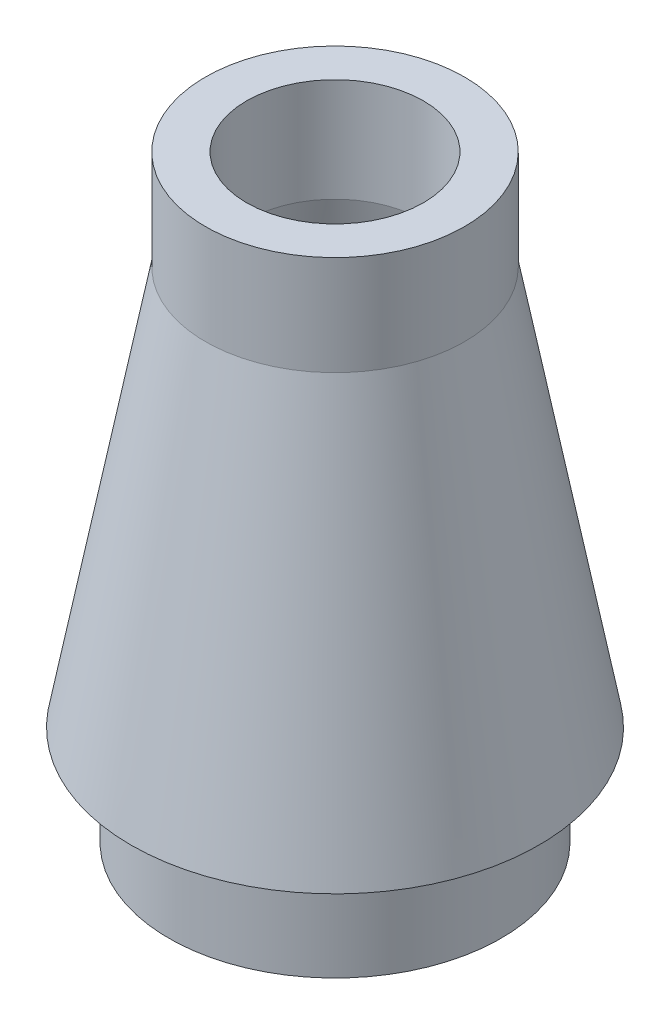
ISO-10303-21;
HEADER;
FILE_DESCRIPTION(('STEP AP214'),'2;1');
FILE_NAME('part.step','',(''),(''),'','','');
FILE_SCHEMA(('AUTOMOTIVE_DESIGN { 1 0 10303 214 1 1 1 1 }'));
ENDSEC;
DATA;
#1=APPLICATION_CONTEXT('core data for automotive mechanical design processes');
#2=APPLICATION_PROTOCOL_DEFINITION('international standard','automotive_design',2000,#1);
#3=PRODUCT_CONTEXT('',#1,'mechanical');
#4=PRODUCT('Part','Part','',(#3));
#5=PRODUCT_RELATED_PRODUCT_CATEGORY('part','',(#4));
#6=PRODUCT_DEFINITION_FORMATION('','',#4);
#7=PRODUCT_DEFINITION_CONTEXT('part definition',#1,'design');
#8=PRODUCT_DEFINITION('design','',#6,#7);
#9=PRODUCT_DEFINITION_SHAPE('','',#8);
#10=(LENGTH_UNIT() NAMED_UNIT(*) SI_UNIT(.MILLI.,.METRE.));
#11=(NAMED_UNIT(*) PLANE_ANGLE_UNIT() SI_UNIT($,.RADIAN.));
#12=(NAMED_UNIT(*) SI_UNIT($,.STERADIAN.) SOLID_ANGLE_UNIT());
#13=UNCERTAINTY_MEASURE_WITH_UNIT(LENGTH_MEASURE(1.E-05),#10,'distance_accuracy_value','');
#14=(GEOMETRIC_REPRESENTATION_CONTEXT(3) GLOBAL_UNCERTAINTY_ASSIGNED_CONTEXT((#13)) GLOBAL_UNIT_ASSIGNED_CONTEXT((#10,
#11,#12)) REPRESENTATION_CONTEXT('',''));
#15=CARTESIAN_POINT('',(0.,0.,0.));
#16=DIRECTION('',(0.,0.,1.));
#17=DIRECTION('',(1.,0.,0.));
#18=AXIS2_PLACEMENT_3D('',#15,#16,#17);
#19=CARTESIAN_POINT('',(0.,11.43,0.));
#20=DIRECTION('',(0.,-1.,0.));
#21=DIRECTION('',(0.,0.,-1.));
#22=AXIS2_PLACEMENT_3D('',#19,#20,#21);
#23=PLANE('',#22);
#24=CARTESIAN_POINT('',(0.,11.43,0.));
#25=DIRECTION('',(0.,-1.,0.));
#26=DIRECTION('',(0.,0.,-1.));
#27=AXIS2_PLACEMENT_3D('',#24,#25,#26);
#28=CIRCLE('',#27,1.6891);
#29=CARTESIAN_POINT('',(0.,11.43,-1.6891));
#30=VERTEX_POINT('',#29);
#31=EDGE_CURVE('E53',#30,#30,#28,.T.);
#32=ORIENTED_EDGE('',*,*,#31,.T.);
#33=EDGE_LOOP('',(#32));
#34=FACE_BOUND('',#33,.T.);
#35=CARTESIAN_POINT('',(0.,11.43,0.));
#36=DIRECTION('',(0.,-1.,0.));
#37=DIRECTION('',(0.,0.,-1.));
#38=AXIS2_PLACEMENT_3D('',#35,#36,#37);
#39=CIRCLE('',#38,2.4765);
#40=CARTESIAN_POINT('',(0.,11.43,-2.4765));
#41=VERTEX_POINT('',#40);
#42=EDGE_CURVE('E10',#41,#41,#39,.T.);
#43=ORIENTED_EDGE('',*,*,#42,.F.);
#44=EDGE_LOOP('',(#43));
#45=FACE_BOUND('',#44,.T.);
#46=ADVANCED_FACE('F31',(#34,#45),#23,.F.);
#47=CARTESIAN_POINT('',(0.,0.,0.));
#48=DIRECTION('',(0.,-1.,0.));
#49=DIRECTION('',(0.,0.,-1.));
#50=AXIS2_PLACEMENT_3D('',#47,#48,#49);
#51=CYLINDRICAL_SURFACE('',#50,2.4765);
#52=CARTESIAN_POINT('',(0.,9.525,0.));
#53=DIRECTION('',(0.,-1.,0.));
#54=DIRECTION('',(0.,0.,-1.));
#55=AXIS2_PLACEMENT_3D('',#52,#53,#54);
#56=CIRCLE('',#55,2.4765);
#57=CARTESIAN_POINT('',(0.,9.525,-2.4765));
#58=VERTEX_POINT('',#57);
#59=EDGE_CURVE('E37',#58,#58,#56,.T.);
#60=ORIENTED_EDGE('',*,*,#59,.F.);
#61=EDGE_LOOP('',(#60));
#62=FACE_BOUND('',#61,.T.);
#63=ORIENTED_EDGE('',*,*,#42,.T.);
#64=EDGE_LOOP('',(#63));
#65=FACE_BOUND('',#64,.T.);
#66=ADVANCED_FACE('F87',(#62,#65),#51,.T.);
#67=CARTESIAN_POINT('',(0.,9.525,0.));
#68=DIRECTION('',(0.,-1.,0.));
#69=DIRECTION('',(0.,0.,-1.));
#70=AXIS2_PLACEMENT_3D('',#67,#68,#69);
#71=CONICAL_SURFACE('',#70,2.4765,0.184542797190615);
#72=CARTESIAN_POINT('',(0.,1.905,0.));
#73=DIRECTION('',(0.,-1.,0.));
#74=DIRECTION('',(0.,0.,-1.));
#75=AXIS2_PLACEMENT_3D('',#72,#73,#74);
#76=CIRCLE('',#75,3.8989);
#77=CARTESIAN_POINT('',(0.,1.905,-3.8989));
#78=VERTEX_POINT('',#77);
#79=EDGE_CURVE('E41',#78,#78,#76,.T.);
#80=ORIENTED_EDGE('',*,*,#79,.F.);
#81=EDGE_LOOP('',(#80));
#82=FACE_BOUND('',#81,.T.);
#83=ORIENTED_EDGE('',*,*,#59,.T.);
#84=EDGE_LOOP('',(#83));
#85=FACE_BOUND('',#84,.T.);
#86=ADVANCED_FACE('F92',(#82,#85),#71,.T.);
#87=CARTESIAN_POINT('',(-3.8989,1.905,0.));
#88=DIRECTION('',(0.,1.,0.));
#89=DIRECTION('',(0.,0.,1.));
#90=AXIS2_PLACEMENT_3D('',#87,#88,#89);
#91=PLANE('',#90);
#92=CARTESIAN_POINT('',(0.,1.905,0.));
#93=DIRECTION('',(0.,-1.,0.));
#94=DIRECTION('',(0.,0.,-1.));
#95=AXIS2_PLACEMENT_3D('',#92,#93,#94);
#96=CIRCLE('',#95,3.175);
#97=CARTESIAN_POINT('',(0.,1.905,-3.175));
#98=VERTEX_POINT('',#97);
#99=EDGE_CURVE('E45',#98,#98,#96,.T.);
#100=ORIENTED_EDGE('',*,*,#99,.F.);
#101=EDGE_LOOP('',(#100));
#102=FACE_BOUND('',#101,.T.);
#103=ORIENTED_EDGE('',*,*,#79,.T.);
#104=EDGE_LOOP('',(#103));
#105=FACE_BOUND('',#104,.T.);
#106=ADVANCED_FACE('F99',(#102,#105),#91,.F.);
#107=CARTESIAN_POINT('',(0.,0.,0.));
#108=DIRECTION('',(0.,-1.,0.));
#109=DIRECTION('',(0.,0.,-1.));
#110=AXIS2_PLACEMENT_3D('',#107,#108,#109);
#111=CYLINDRICAL_SURFACE('',#110,3.175);
#112=CARTESIAN_POINT('',(0.,0.,0.));
#113=DIRECTION('',(0.,-1.,0.));
#114=DIRECTION('',(0.,0.,-1.));
#115=AXIS2_PLACEMENT_3D('',#112,#113,#114);
#116=CIRCLE('',#115,3.175);
#117=CARTESIAN_POINT('',(0.,0.,-3.175));
#118=VERTEX_POINT('',#117);
#119=EDGE_CURVE('E50',#118,#118,#116,.T.);
#120=ORIENTED_EDGE('',*,*,#119,.F.);
#121=EDGE_LOOP('',(#120));
#122=FACE_BOUND('',#121,.T.);
#123=ORIENTED_EDGE('',*,*,#99,.T.);
#124=EDGE_LOOP('',(#123));
#125=FACE_BOUND('',#124,.T.);
#126=ADVANCED_FACE('F105',(#122,#125),#111,.T.);
#127=CARTESIAN_POINT('',(-3.175,0.,0.));
#128=DIRECTION('',(0.,1.,0.));
#129=DIRECTION('',(0.,0.,1.));
#130=AXIS2_PLACEMENT_3D('',#127,#128,#129);
#131=PLANE('',#130);
#132=CARTESIAN_POINT('',(0.,0.,0.));
#133=DIRECTION('',(0.,1.,0.));
#134=DIRECTION('',(0.,0.,1.));
#135=AXIS2_PLACEMENT_3D('',#132,#133,#134);
#136=CIRCLE('',#135,2.3876);
#137=CARTESIAN_POINT('',(0.,0.,2.3876));
#138=VERTEX_POINT('',#137);
#139=EDGE_CURVE('E54',#138,#138,#136,.F.);
#140=ORIENTED_EDGE('',*,*,#139,.F.);
#141=EDGE_LOOP('',(#140));
#142=FACE_BOUND('',#141,.T.);
#143=ORIENTED_EDGE('',*,*,#119,.T.);
#144=EDGE_LOOP('',(#143));
#145=FACE_BOUND('',#144,.T.);
#146=ADVANCED_FACE('F84',(#142,#145),#131,.F.);
#147=CARTESIAN_POINT('',(0.,0.,0.));
#148=DIRECTION('',(0.,-1.,0.));
#149=DIRECTION('',(0.,0.,-1.));
#150=AXIS2_PLACEMENT_3D('',#147,#148,#149);
#151=CYLINDRICAL_SURFACE('',#150,1.6891);
#152=CARTESIAN_POINT('',(0.,9.4521386023682,0.));
#153=DIRECTION('',(0.,-1.,0.));
#154=DIRECTION('',(0.,0.,-1.));
#155=AXIS2_PLACEMENT_3D('',#152,#153,#154);
#156=CIRCLE('',#155,1.6891);
#157=CARTESIAN_POINT('',(0.,9.4521386023682,-1.6891));
#158=VERTEX_POINT('',#157);
#159=EDGE_CURVE('E60',#158,#158,#156,.T.);
#160=ORIENTED_EDGE('',*,*,#159,.T.);
#161=EDGE_LOOP('',(#160));
#162=FACE_BOUND('',#161,.T.);
#163=ORIENTED_EDGE('',*,*,#31,.F.);
#164=EDGE_LOOP('',(#163));
#165=FACE_BOUND('',#164,.T.);
#166=ADVANCED_FACE('F69',(#162,#165),#151,.F.);
#167=CARTESIAN_POINT('',(0.,9.38051437314279,0.));
#168=DIRECTION('',(0.,-1.,0.));
#169=DIRECTION('',(0.,0.,-1.));
#170=AXIS2_PLACEMENT_3D('',#167,#168,#169);
#171=CONICAL_SURFACE('',#170,1.70246985612208,0.184542797190615);
#172=CARTESIAN_POINT('',(0.,2.6924,0.));
#173=DIRECTION('',(0.,1.,0.));
#174=DIRECTION('',(0.,0.,1.));
#175=AXIS2_PLACEMENT_3D('',#172,#173,#174);
#176=CIRCLE('',#175,2.95091787244206);
#177=CARTESIAN_POINT('',(0.,2.6924,2.95091787244206));
#178=VERTEX_POINT('',#177);
#179=EDGE_CURVE('E63',#178,#178,#176,.F.);
#180=ORIENTED_EDGE('',*,*,#179,.T.);
#181=EDGE_LOOP('',(#180));
#182=FACE_BOUND('',#181,.T.);
#183=ORIENTED_EDGE('',*,*,#159,.F.);
#184=EDGE_LOOP('',(#183));
#185=FACE_BOUND('',#184,.T.);
#186=ADVANCED_FACE('F72',(#182,#185),#171,.F.);
#187=CARTESIAN_POINT('',(-3.8989,2.6924,0.));
#188=DIRECTION('',(0.,1.,0.));
#189=DIRECTION('',(0.,0.,1.));
#190=AXIS2_PLACEMENT_3D('',#187,#188,#189);
#191=PLANE('',#190);
#192=CARTESIAN_POINT('',(0.,2.6924,0.));
#193=DIRECTION('',(0.,1.,0.));
#194=DIRECTION('',(0.,0.,1.));
#195=AXIS2_PLACEMENT_3D('',#192,#193,#194);
#196=CIRCLE('',#195,2.3876);
#197=CARTESIAN_POINT('',(0.,2.6924,2.3876));
#198=VERTEX_POINT('',#197);
#199=EDGE_CURVE('E57',#198,#198,#196,.F.);
#200=ORIENTED_EDGE('',*,*,#199,.T.);
#201=EDGE_LOOP('',(#200));
#202=FACE_BOUND('',#201,.T.);
#203=ORIENTED_EDGE('',*,*,#179,.F.);
#204=EDGE_LOOP('',(#203));
#205=FACE_BOUND('',#204,.T.);
#206=ADVANCED_FACE('F74',(#202,#205),#191,.T.);
#207=CARTESIAN_POINT('',(0.,0.,0.));
#208=DIRECTION('',(0.,-1.,0.));
#209=DIRECTION('',(0.,0.,-1.));
#210=AXIS2_PLACEMENT_3D('',#207,#208,#209);
#211=CYLINDRICAL_SURFACE('',#210,2.3876);
#212=ORIENTED_EDGE('',*,*,#139,.T.);
#213=EDGE_LOOP('',(#212));
#214=FACE_BOUND('',#213,.T.);
#215=ORIENTED_EDGE('',*,*,#199,.F.);
#216=EDGE_LOOP('',(#215));
#217=FACE_BOUND('',#216,.T.);
#218=ADVANCED_FACE('F81',(#214,#217),#211,.F.);
#219=CLOSED_SHELL('',(#46,#66,#86,#106,#126,#146,#166,#186,#206,#218));
#220=MANIFOLD_SOLID_BREP('B2',#219);
#221=ADVANCED_BREP_SHAPE_REPRESENTATION('',(#18,#220),#14);
#222=SHAPE_DEFINITION_REPRESENTATION(#9,#221);
ENDSEC;
END-ISO-10303-21;
